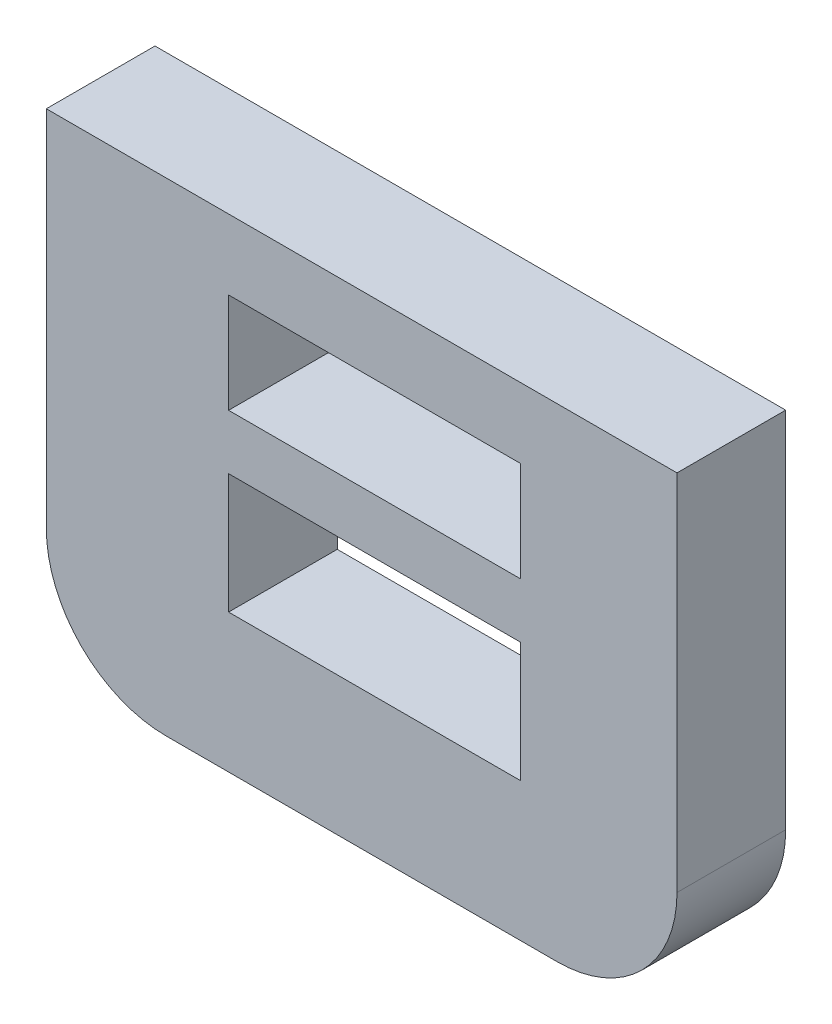
ISO-10303-21;
HEADER;
FILE_DESCRIPTION(('STEP AP214'),'2;1');
FILE_NAME('part.step','',(''),(''),'','','');
FILE_SCHEMA(('AUTOMOTIVE_DESIGN { 1 0 10303 214 1 1 1 1 }'));
ENDSEC;
DATA;
#1=APPLICATION_CONTEXT('core data for automotive mechanical design processes');
#2=APPLICATION_PROTOCOL_DEFINITION('international standard','automotive_design',2000,#1);
#3=PRODUCT_CONTEXT('',#1,'mechanical');
#4=PRODUCT('Part','Part','',(#3));
#5=PRODUCT_RELATED_PRODUCT_CATEGORY('part','',(#4));
#6=PRODUCT_DEFINITION_FORMATION('','',#4);
#7=PRODUCT_DEFINITION_CONTEXT('part definition',#1,'design');
#8=PRODUCT_DEFINITION('design','',#6,#7);
#9=PRODUCT_DEFINITION_SHAPE('','',#8);
#10=(LENGTH_UNIT() NAMED_UNIT(*) SI_UNIT(.MILLI.,.METRE.));
#11=(NAMED_UNIT(*) PLANE_ANGLE_UNIT() SI_UNIT($,.RADIAN.));
#12=(NAMED_UNIT(*) SI_UNIT($,.STERADIAN.) SOLID_ANGLE_UNIT());
#13=UNCERTAINTY_MEASURE_WITH_UNIT(LENGTH_MEASURE(1.E-05),#10,'distance_accuracy_value','');
#14=(GEOMETRIC_REPRESENTATION_CONTEXT(3) GLOBAL_UNCERTAINTY_ASSIGNED_CONTEXT((#13)) GLOBAL_UNIT_ASSIGNED_CONTEXT((#10,
#11,#12)) REPRESENTATION_CONTEXT('',''));
#15=CARTESIAN_POINT('',(0.,0.,0.));
#16=DIRECTION('',(0.,0.,1.));
#17=DIRECTION('',(1.,0.,0.));
#18=AXIS2_PLACEMENT_3D('',#15,#16,#17);
#19=CARTESIAN_POINT('',(-38.033753800412,-414.522040930803,22.6018486611492));
#20=DIRECTION('',(1.,0.,0.));
#21=DIRECTION('',(0.,1.,0.));
#22=AXIS2_PLACEMENT_3D('',#19,#20,#21);
#23=PLANE('',#22);
#24=DIRECTION('',(0.,-1.,0.));
#25=VECTOR('',#24,1.);
#26=CARTESIAN_POINT('',(-38.033753800412,-414.522040930802,2.71944846988061));
#27=LINE('',#26,#25);
#28=CARTESIAN_POINT('',(-38.0337538004116,-405.428571357745,2.71944846988085));
#29=VERTEX_POINT('',#28);
#30=CARTESIAN_POINT('',(-38.033753800412,-414.522040930803,2.71944846988061));
#31=VERTEX_POINT('',#30);
#32=EDGE_CURVE('E271',#29,#31,#27,.T.);
#33=ORIENTED_EDGE('',*,*,#32,.F.);
#34=DIRECTION('',(0.,0.,-1.));
#35=VECTOR('',#34,1.);
#36=CARTESIAN_POINT('',(-38.0337538004116,-405.428571357745,22.6018486611492));
#37=LINE('',#36,#35);
#38=CARTESIAN_POINT('',(-38.0337538004116,-405.428571357745,0.));
#39=VERTEX_POINT('',#38);
#40=EDGE_CURVE('E47',#29,#39,#37,.T.);
#41=ORIENTED_EDGE('',*,*,#40,.T.);
#42=DIRECTION('',(0.,-1.,0.));
#43=VECTOR('',#42,1.);
#44=CARTESIAN_POINT('',(-38.033753800412,-414.522040930803,0.));
#45=LINE('',#44,#43);
#46=CARTESIAN_POINT('',(-38.033753800412,-414.522040930803,0.));
#47=VERTEX_POINT('',#46);
#48=EDGE_CURVE('E195',#39,#47,#45,.T.);
#49=ORIENTED_EDGE('',*,*,#48,.T.);
#50=DIRECTION('',(0.,0.,-1.));
#51=VECTOR('',#50,1.);
#52=CARTESIAN_POINT('',(-38.033753800412,-414.522040930803,22.6018486611492));
#53=LINE('',#52,#51);
#54=EDGE_CURVE('E198',#31,#47,#53,.T.);
#55=ORIENTED_EDGE('',*,*,#54,.F.);
#56=EDGE_LOOP('',(#33,#41,#49,#55));
#57=FACE_BOUND('',#56,.T.);
#58=ADVANCED_FACE('F32',(#57),#23,.F.);
#59=CARTESIAN_POINT('',(-38.0337538004116,-405.428571357745,22.6018486611492));
#60=DIRECTION('',(0.,-1.,0.));
#61=DIRECTION('',(1.,0.,0.));
#62=AXIS2_PLACEMENT_3D('',#59,#60,#61);
#63=PLANE('',#62);
#64=DIRECTION('',(-1.,0.,0.));
#65=VECTOR('',#64,1.);
#66=CARTESIAN_POINT('',(-38.0337538004116,-405.428571357745,2.71944846988108));
#67=LINE('',#66,#65);
#68=CARTESIAN_POINT('',(-22.2521876217571,-405.428571357747,2.71944846988108));
#69=VERTEX_POINT('',#68);
#70=EDGE_CURVE('E230',#69,#29,#67,.T.);
#71=ORIENTED_EDGE('',*,*,#70,.F.);
#72=DIRECTION('',(0.,0.,-1.));
#73=VECTOR('',#72,1.);
#74=CARTESIAN_POINT('',(-22.2521876217571,-405.428571357747,22.6018486611492));
#75=LINE('',#74,#73);
#76=CARTESIAN_POINT('',(-22.2521876217571,-405.428571357747,0.));
#77=VERTEX_POINT('',#76);
#78=EDGE_CURVE('E201',#69,#77,#75,.T.);
#79=ORIENTED_EDGE('',*,*,#78,.T.);
#80=DIRECTION('',(-1.,0.,0.));
#81=VECTOR('',#80,1.);
#82=CARTESIAN_POINT('',(-38.0337538004116,-405.428571357745,0.));
#83=LINE('',#82,#81);
#84=EDGE_CURVE('E193',#77,#39,#83,.T.);
#85=ORIENTED_EDGE('',*,*,#84,.T.);
#86=ORIENTED_EDGE('',*,*,#40,.F.);
#87=EDGE_LOOP('',(#71,#79,#85,#86));
#88=FACE_BOUND('',#87,.T.);
#89=ADVANCED_FACE('F227',(#88),#63,.F.);
#90=CARTESIAN_POINT('',(-22.2521876217571,-405.428571357747,22.6018486611492));
#91=DIRECTION('',(-1.,0.,0.));
#92=DIRECTION('',(0.,-1.,0.));
#93=AXIS2_PLACEMENT_3D('',#90,#91,#92);
#94=PLANE('',#93);
#95=DIRECTION('',(0.,1.,0.));
#96=VECTOR('',#95,1.);
#97=CARTESIAN_POINT('',(-22.2521876217571,-405.428571357746,2.71944846988108));
#98=LINE('',#97,#96);
#99=CARTESIAN_POINT('',(-22.2521876217575,-414.522040930804,2.71944846988084));
#100=VERTEX_POINT('',#99);
#101=EDGE_CURVE('E235',#100,#69,#98,.T.);
#102=ORIENTED_EDGE('',*,*,#101,.F.);
#103=DIRECTION('',(0.,0.,-1.));
#104=VECTOR('',#103,1.);
#105=CARTESIAN_POINT('',(-22.2521876217575,-414.522040930804,22.6018486611492));
#106=LINE('',#105,#104);
#107=CARTESIAN_POINT('',(-22.2521876217575,-414.522040930804,0.));
#108=VERTEX_POINT('',#107);
#109=EDGE_CURVE('E203',#100,#108,#106,.T.);
#110=ORIENTED_EDGE('',*,*,#109,.T.);
#111=DIRECTION('',(0.,1.,0.));
#112=VECTOR('',#111,1.);
#113=CARTESIAN_POINT('',(-22.2521876217571,-405.428571357747,0.));
#114=LINE('',#113,#112);
#115=EDGE_CURVE('E190',#108,#77,#114,.T.);
#116=ORIENTED_EDGE('',*,*,#115,.T.);
#117=ORIENTED_EDGE('',*,*,#78,.F.);
#118=EDGE_LOOP('',(#102,#110,#116,#117));
#119=FACE_BOUND('',#118,.T.);
#120=ADVANCED_FACE('F233',(#119),#94,.F.);
#121=CARTESIAN_POINT('',(-25.2521876217575,-414.522040930804,22.6018486611492));
#122=DIRECTION('',(0.,0.,-1.));
#123=DIRECTION('',(-1.,0.,0.));
#124=AXIS2_PLACEMENT_3D('',#121,#122,#123);
#125=CYLINDRICAL_SURFACE('',#124,3.);
#126=CARTESIAN_POINT('',(-25.2521876217575,-414.522040930804,2.71944846988061));
#127=DIRECTION('',(0.,0.,1.));
#128=DIRECTION('',(0.,-1.,0.));
#129=AXIS2_PLACEMENT_3D('',#126,#127,#128);
#130=CIRCLE('',#129,3.);
#131=CARTESIAN_POINT('',(-25.2521876217578,-417.522040930804,2.71944846988045));
#132=VERTEX_POINT('',#131);
#133=EDGE_CURVE('E239',#132,#100,#130,.T.);
#134=ORIENTED_EDGE('',*,*,#133,.F.);
#135=DIRECTION('',(0.,0.,-1.));
#136=VECTOR('',#135,1.);
#137=CARTESIAN_POINT('',(-25.2521876217578,-417.522040930804,22.6018486611492));
#138=LINE('',#137,#136);
#139=CARTESIAN_POINT('',(-25.2521876217578,-417.522040930804,0.));
#140=VERTEX_POINT('',#139);
#141=EDGE_CURVE('E205',#132,#140,#138,.T.);
#142=ORIENTED_EDGE('',*,*,#141,.T.);
#143=CARTESIAN_POINT('',(-25.2521876217575,-414.522040930804,0.));
#144=DIRECTION('',(0.,0.,1.));
#145=DIRECTION('',(1.,0.,0.));
#146=AXIS2_PLACEMENT_3D('',#143,#144,#145);
#147=CIRCLE('',#146,3.);
#148=EDGE_CURVE('E187',#140,#108,#147,.T.);
#149=ORIENTED_EDGE('',*,*,#148,.T.);
#150=ORIENTED_EDGE('',*,*,#109,.F.);
#151=EDGE_LOOP('',(#134,#142,#149,#150));
#152=FACE_BOUND('',#151,.T.);
#153=ADVANCED_FACE('F238',(#152),#125,.T.);
#154=CARTESIAN_POINT('',(-25.2521876217578,-417.522040930804,22.6018486611492));
#155=DIRECTION('',(0.,1.,0.));
#156=DIRECTION('',(-1.,0.,0.));
#157=AXIS2_PLACEMENT_3D('',#154,#155,#156);
#158=PLANE('',#157);
#159=DIRECTION('',(1.,0.,0.));
#160=VECTOR('',#159,1.);
#161=CARTESIAN_POINT('',(-25.2521876217578,-417.522040930804,2.71944846988045));
#162=LINE('',#161,#160);
#163=CARTESIAN_POINT('',(-35.0337538004122,-417.522040930803,2.71944846988045));
#164=VERTEX_POINT('',#163);
#165=EDGE_CURVE('E213',#164,#132,#162,.T.);
#166=ORIENTED_EDGE('',*,*,#165,.F.);
#167=DIRECTION('',(0.,0.,-1.));
#168=VECTOR('',#167,1.);
#169=CARTESIAN_POINT('',(-35.0337538004122,-417.522040930803,22.6018486611492));
#170=LINE('',#169,#168);
#171=CARTESIAN_POINT('',(-35.0337538004122,-417.522040930803,0.));
#172=VERTEX_POINT('',#171);
#173=EDGE_CURVE('E40',#164,#172,#170,.T.);
#174=ORIENTED_EDGE('',*,*,#173,.T.);
#175=DIRECTION('',(1.,0.,0.));
#176=VECTOR('',#175,1.);
#177=CARTESIAN_POINT('',(-25.2521876217578,-417.522040930804,0.));
#178=LINE('',#177,#176);
#179=EDGE_CURVE('E184',#172,#140,#178,.T.);
#180=ORIENTED_EDGE('',*,*,#179,.T.);
#181=ORIENTED_EDGE('',*,*,#141,.F.);
#182=EDGE_LOOP('',(#166,#174,#180,#181));
#183=FACE_BOUND('',#182,.T.);
#184=ADVANCED_FACE('F209',(#183),#158,.F.);
#185=CARTESIAN_POINT('',(-35.033753800412,-414.522040930803,22.6018486611492));
#186=DIRECTION('',(0.,0.,-1.));
#187=DIRECTION('',(-1.,0.,0.));
#188=AXIS2_PLACEMENT_3D('',#185,#186,#187);
#189=CYLINDRICAL_SURFACE('',#188,3.00000000000001);
#190=CARTESIAN_POINT('',(-35.033753800412,-414.522040930803,2.71944846988061));
#191=DIRECTION('',(0.,0.,1.));
#192=DIRECTION('',(0.,-1.,0.));
#193=AXIS2_PLACEMENT_3D('',#190,#191,#192);
#194=CIRCLE('',#193,3.00000000000001);
#195=EDGE_CURVE('E223',#31,#164,#194,.T.);
#196=ORIENTED_EDGE('',*,*,#195,.F.);
#197=ORIENTED_EDGE('',*,*,#54,.T.);
#198=CARTESIAN_POINT('',(-35.033753800412,-414.522040930803,0.));
#199=DIRECTION('',(0.,0.,1.));
#200=DIRECTION('',(1.,0.,0.));
#201=AXIS2_PLACEMENT_3D('',#198,#199,#200);
#202=CIRCLE('',#201,3.00000000000001);
#203=EDGE_CURVE('E181',#47,#172,#202,.T.);
#204=ORIENTED_EDGE('',*,*,#203,.T.);
#205=ORIENTED_EDGE('',*,*,#173,.F.);
#206=EDGE_LOOP('',(#196,#197,#204,#205));
#207=FACE_BOUND('',#206,.T.);
#208=ADVANCED_FACE('F34',(#207),#189,.T.);
#209=CARTESIAN_POINT('',(-33.4727150959694,-411.055740741814,22.6018486611492));
#210=DIRECTION('',(1.,0.,0.));
#211=DIRECTION('',(0.,1.,0.));
#212=AXIS2_PLACEMENT_3D('',#209,#210,#211);
#213=PLANE('',#212);
#214=DIRECTION('',(0.,0.,-1.));
#215=VECTOR('',#214,1.);
#216=CARTESIAN_POINT('',(-33.4727150959694,-411.055740741814,22.6018486611492));
#217=LINE('',#216,#215);
#218=CARTESIAN_POINT('',(-33.4727150959694,-411.055740741814,2.71944846988079));
#219=VERTEX_POINT('',#218);
#220=CARTESIAN_POINT('',(-33.4727150959694,-411.055740741814,0.));
#221=VERTEX_POINT('',#220);
#222=EDGE_CURVE('E175',#219,#221,#217,.T.);
#223=ORIENTED_EDGE('',*,*,#222,.F.);
#224=DIRECTION('',(0.,-1.,0.));
#225=VECTOR('',#224,1.);
#226=CARTESIAN_POINT('',(-33.4727150959694,-411.055740741813,2.71944846988079));
#227=LINE('',#226,#225);
#228=CARTESIAN_POINT('',(-33.4727150959696,-414.055740741813,2.71944846988071));
#229=VERTEX_POINT('',#228);
#230=EDGE_CURVE('E259',#219,#229,#227,.T.);
#231=ORIENTED_EDGE('',*,*,#230,.T.);
#232=DIRECTION('',(0.,0.,-1.));
#233=VECTOR('',#232,1.);
#234=CARTESIAN_POINT('',(-33.4727150959696,-414.055740741813,22.6018486611492));
#235=LINE('',#234,#233);
#236=CARTESIAN_POINT('',(-33.4727150959696,-414.055740741813,0.));
#237=VERTEX_POINT('',#236);
#238=EDGE_CURVE('E173',#229,#237,#235,.T.);
#239=ORIENTED_EDGE('',*,*,#238,.T.);
#240=DIRECTION('',(0.,-1.,0.));
#241=VECTOR('',#240,1.);
#242=CARTESIAN_POINT('',(-33.4727150959694,-411.055740741814,0.));
#243=LINE('',#242,#241);
#244=EDGE_CURVE('E170',#221,#237,#243,.T.);
#245=ORIENTED_EDGE('',*,*,#244,.F.);
#246=EDGE_LOOP('',(#223,#231,#239,#245));
#247=FACE_BOUND('',#246,.T.);
#248=ADVANCED_FACE('F281',(#247),#213,.T.);
#249=CARTESIAN_POINT('',(-26.1675249239516,-411.055740741814,22.6018486611492));
#250=DIRECTION('',(0.,-1.,0.));
#251=DIRECTION('',(1.,0.,0.));
#252=AXIS2_PLACEMENT_3D('',#249,#250,#251);
#253=PLANE('',#252);
#254=DIRECTION('',(0.,0.,-1.));
#255=VECTOR('',#254,1.);
#256=CARTESIAN_POINT('',(-26.1675249239516,-411.055740741814,22.6018486611492));
#257=LINE('',#256,#255);
#258=CARTESIAN_POINT('',(-26.1675249239516,-411.055740741814,2.71944846988079));
#259=VERTEX_POINT('',#258);
#260=CARTESIAN_POINT('',(-26.1675249239516,-411.055740741814,0.));
#261=VERTEX_POINT('',#260);
#262=EDGE_CURVE('E177',#259,#261,#257,.T.);
#263=ORIENTED_EDGE('',*,*,#262,.F.);
#264=DIRECTION('',(-1.,0.,0.));
#265=VECTOR('',#264,1.);
#266=CARTESIAN_POINT('',(-26.1675249239516,-411.055740741814,2.71944846988079));
#267=LINE('',#266,#265);
#268=EDGE_CURVE('E264',#259,#219,#267,.T.);
#269=ORIENTED_EDGE('',*,*,#268,.T.);
#270=ORIENTED_EDGE('',*,*,#222,.T.);
#271=DIRECTION('',(-1.,0.,0.));
#272=VECTOR('',#271,1.);
#273=CARTESIAN_POINT('',(-26.1675249239516,-411.055740741814,0.));
#274=LINE('',#273,#272);
#275=EDGE_CURVE('E167',#261,#221,#274,.T.);
#276=ORIENTED_EDGE('',*,*,#275,.F.);
#277=EDGE_LOOP('',(#263,#269,#270,#276));
#278=FACE_BOUND('',#277,.T.);
#279=ADVANCED_FACE('F284',(#278),#253,.T.);
#280=CARTESIAN_POINT('',(-26.1675249239518,-414.055740741814,22.6018486611492));
#281=DIRECTION('',(-1.,0.,0.));
#282=DIRECTION('',(0.,-1.,0.));
#283=AXIS2_PLACEMENT_3D('',#280,#281,#282);
#284=PLANE('',#283);
#285=DIRECTION('',(0.,0.,-1.));
#286=VECTOR('',#285,1.);
#287=CARTESIAN_POINT('',(-26.1675249239518,-414.055740741814,22.6018486611492));
#288=LINE('',#287,#286);
#289=CARTESIAN_POINT('',(-26.1675249239518,-414.055740741814,2.71944846988063));
#290=VERTEX_POINT('',#289);
#291=CARTESIAN_POINT('',(-26.1675249239518,-414.055740741814,0.));
#292=VERTEX_POINT('',#291);
#293=EDGE_CURVE('E179',#290,#292,#288,.T.);
#294=ORIENTED_EDGE('',*,*,#293,.F.);
#295=DIRECTION('',(0.,1.,0.));
#296=VECTOR('',#295,1.);
#297=CARTESIAN_POINT('',(-26.1675249239518,-414.055740741813,2.71944846988063));
#298=LINE('',#297,#296);
#299=EDGE_CURVE('E267',#290,#259,#298,.T.);
#300=ORIENTED_EDGE('',*,*,#299,.T.);
#301=ORIENTED_EDGE('',*,*,#262,.T.);
#302=DIRECTION('',(0.,1.,0.));
#303=VECTOR('',#302,1.);
#304=CARTESIAN_POINT('',(-26.1675249239518,-414.055740741814,0.));
#305=LINE('',#304,#303);
#306=EDGE_CURVE('E164',#292,#261,#305,.T.);
#307=ORIENTED_EDGE('',*,*,#306,.F.);
#308=EDGE_LOOP('',(#294,#300,#301,#307));
#309=FACE_BOUND('',#308,.T.);
#310=ADVANCED_FACE('F287',(#309),#284,.T.);
#311=CARTESIAN_POINT('',(-33.4727150959696,-414.055740741813,22.6018486611492));
#312=DIRECTION('',(0.,1.,0.));
#313=DIRECTION('',(-1.,0.,0.));
#314=AXIS2_PLACEMENT_3D('',#311,#312,#313);
#315=PLANE('',#314);
#316=ORIENTED_EDGE('',*,*,#238,.F.);
#317=DIRECTION('',(1.,0.,0.));
#318=VECTOR('',#317,1.);
#319=CARTESIAN_POINT('',(-33.4727150959696,-414.055740741813,2.71944846988063));
#320=LINE('',#319,#318);
#321=EDGE_CURVE('E55',#229,#290,#320,.T.);
#322=ORIENTED_EDGE('',*,*,#321,.T.);
#323=ORIENTED_EDGE('',*,*,#293,.T.);
#324=DIRECTION('',(1.,0.,0.));
#325=VECTOR('',#324,1.);
#326=CARTESIAN_POINT('',(-33.4727150959696,-414.055740741813,0.));
#327=LINE('',#326,#325);
#328=EDGE_CURVE('E161',#237,#292,#327,.T.);
#329=ORIENTED_EDGE('',*,*,#328,.F.);
#330=EDGE_LOOP('',(#316,#322,#323,#329));
#331=FACE_BOUND('',#330,.T.);
#332=ADVANCED_FACE('F274',(#331),#315,.T.);
#333=CARTESIAN_POINT('',(-35.033753800412,-414.522040930803,0.));
#334=DIRECTION('',(0.,0.,1.));
#335=DIRECTION('',(1.,0.,0.));
#336=AXIS2_PLACEMENT_3D('',#333,#334,#335);
#337=PLANE('',#336);
#338=ORIENTED_EDGE('',*,*,#328,.T.);
#339=ORIENTED_EDGE('',*,*,#306,.T.);
#340=ORIENTED_EDGE('',*,*,#275,.T.);
#341=ORIENTED_EDGE('',*,*,#244,.T.);
#342=EDGE_LOOP('',(#338,#339,#340,#341));
#343=FACE_BOUND('',#342,.T.);
#344=ORIENTED_EDGE('',*,*,#203,.F.);
#345=ORIENTED_EDGE('',*,*,#48,.F.);
#346=ORIENTED_EDGE('',*,*,#84,.F.);
#347=ORIENTED_EDGE('',*,*,#115,.F.);
#348=ORIENTED_EDGE('',*,*,#148,.F.);
#349=ORIENTED_EDGE('',*,*,#179,.F.);
#350=EDGE_LOOP('',(#344,#345,#346,#347,#348,#349));
#351=FACE_BOUND('',#350,.T.);
#352=DIRECTION('',(0.,-1.,0.));
#353=VECTOR('',#352,1.);
#354=CARTESIAN_POINT('',(-33.4727150959637,-407.182910125892,0.));
#355=LINE('',#354,#353);
#356=CARTESIAN_POINT('',(-33.4727150959637,-407.182910125892,0.));
#357=VERTEX_POINT('',#356);
#358=CARTESIAN_POINT('',(-33.4727150959639,-409.682910125892,0.));
#359=VERTEX_POINT('',#358);
#360=EDGE_CURVE('E242',#357,#359,#355,.T.);
#361=ORIENTED_EDGE('',*,*,#360,.T.);
#362=DIRECTION('',(1.,0.,0.));
#363=VECTOR('',#362,1.);
#364=CARTESIAN_POINT('',(-26.1675249239509,-409.682910125892,0.));
#365=LINE('',#364,#363);
#366=CARTESIAN_POINT('',(-26.1675249239509,-409.682910125892,0.));
#367=VERTEX_POINT('',#366);
#368=EDGE_CURVE('E249',#359,#367,#365,.T.);
#369=ORIENTED_EDGE('',*,*,#368,.T.);
#370=DIRECTION('',(0.,1.,0.));
#371=VECTOR('',#370,1.);
#372=CARTESIAN_POINT('',(-26.1675249239509,-409.682910125892,0.));
#373=LINE('',#372,#371);
#374=CARTESIAN_POINT('',(-26.1675249239507,-407.182910125892,0.));
#375=VERTEX_POINT('',#374);
#376=EDGE_CURVE('E252',#367,#375,#373,.T.);
#377=ORIENTED_EDGE('',*,*,#376,.T.);
#378=DIRECTION('',(-1.,0.,0.));
#379=VECTOR('',#378,1.);
#380=CARTESIAN_POINT('',(-26.1675249239507,-407.182910125892,0.));
#381=LINE('',#380,#379);
#382=EDGE_CURVE('E151',#375,#357,#381,.T.);
#383=ORIENTED_EDGE('',*,*,#382,.T.);
#384=EDGE_LOOP('',(#361,#369,#377,#383));
#385=FACE_BOUND('',#384,.T.);
#386=ADVANCED_FACE('F219',(#343,#351,#385),#337,.F.);
#387=CARTESIAN_POINT('',(-26.1675249239507,-407.182910125892,22.6018486611492));
#388=DIRECTION('',(0.,-1.,0.));
#389=DIRECTION('',(1.,0.,0.));
#390=AXIS2_PLACEMENT_3D('',#387,#388,#389);
#391=PLANE('',#390);
#392=DIRECTION('',(0.,0.,-1.));
#393=VECTOR('',#392,1.);
#394=CARTESIAN_POINT('',(-26.1675249239507,-407.182910125892,22.6018486611492));
#395=LINE('',#394,#393);
#396=CARTESIAN_POINT('',(-26.1675249239507,-407.182910125892,2.71944846988099));
#397=VERTEX_POINT('',#396);
#398=EDGE_CURVE('E143',#397,#375,#395,.T.);
#399=ORIENTED_EDGE('',*,*,#398,.F.);
#400=DIRECTION('',(-1.,0.,0.));
#401=VECTOR('',#400,1.);
#402=CARTESIAN_POINT('',(-26.1675249239508,-407.182910125892,2.71944846988099));
#403=LINE('',#402,#401);
#404=CARTESIAN_POINT('',(-33.4727150959637,-407.182910125892,2.71944846988099));
#405=VERTEX_POINT('',#404);
#406=EDGE_CURVE('E11',#397,#405,#403,.T.);
#407=ORIENTED_EDGE('',*,*,#406,.T.);
#408=DIRECTION('',(0.,0.,-1.));
#409=VECTOR('',#408,1.);
#410=CARTESIAN_POINT('',(-33.4727150959637,-407.182910125892,22.6018486611492));
#411=LINE('',#410,#409);
#412=EDGE_CURVE('E153',#405,#357,#411,.T.);
#413=ORIENTED_EDGE('',*,*,#412,.T.);
#414=ORIENTED_EDGE('',*,*,#382,.F.);
#415=EDGE_LOOP('',(#399,#407,#413,#414));
#416=FACE_BOUND('',#415,.T.);
#417=ADVANCED_FACE('F149',(#416),#391,.T.);
#418=CARTESIAN_POINT('',(-26.1675249239509,-409.682910125892,22.6018486611492));
#419=DIRECTION('',(-1.,0.,0.));
#420=DIRECTION('',(0.,-1.,0.));
#421=AXIS2_PLACEMENT_3D('',#418,#419,#420);
#422=PLANE('',#421);
#423=DIRECTION('',(0.,0.,-1.));
#424=VECTOR('',#423,1.);
#425=CARTESIAN_POINT('',(-26.1675249239509,-409.682910125892,22.6018486611492));
#426=LINE('',#425,#424);
#427=CARTESIAN_POINT('',(-26.1675249239509,-409.682910125892,2.71944846988086));
#428=VERTEX_POINT('',#427);
#429=EDGE_CURVE('E145',#428,#367,#426,.T.);
#430=ORIENTED_EDGE('',*,*,#429,.F.);
#431=DIRECTION('',(0.,1.,0.));
#432=VECTOR('',#431,1.);
#433=CARTESIAN_POINT('',(-26.1675249239509,-409.682910125891,2.71944846988086));
#434=LINE('',#433,#432);
#435=EDGE_CURVE('E133',#428,#397,#434,.T.);
#436=ORIENTED_EDGE('',*,*,#435,.T.);
#437=ORIENTED_EDGE('',*,*,#398,.T.);
#438=ORIENTED_EDGE('',*,*,#376,.F.);
#439=EDGE_LOOP('',(#430,#436,#437,#438));
#440=FACE_BOUND('',#439,.T.);
#441=ADVANCED_FACE('F141',(#440),#422,.T.);
#442=CARTESIAN_POINT('',(-26.1675249239509,-409.682910125892,22.6018486611492));
#443=DIRECTION('',(0.,1.,0.));
#444=DIRECTION('',(-1.,0.,0.));
#445=AXIS2_PLACEMENT_3D('',#442,#443,#444);
#446=PLANE('',#445);
#447=DIRECTION('',(0.,0.,-1.));
#448=VECTOR('',#447,1.);
#449=CARTESIAN_POINT('',(-33.4727150959639,-409.682910125892,22.6018486611492));
#450=LINE('',#449,#448);
#451=CARTESIAN_POINT('',(-33.4727150959639,-409.682910125892,2.71944846988086));
#452=VERTEX_POINT('',#451);
#453=EDGE_CURVE('E155',#452,#359,#450,.T.);
#454=ORIENTED_EDGE('',*,*,#453,.F.);
#455=DIRECTION('',(1.,0.,0.));
#456=VECTOR('',#455,1.);
#457=CARTESIAN_POINT('',(-26.1675249239509,-409.682910125892,2.71944846988086));
#458=LINE('',#457,#456);
#459=EDGE_CURVE('E147',#452,#428,#458,.T.);
#460=ORIENTED_EDGE('',*,*,#459,.T.);
#461=ORIENTED_EDGE('',*,*,#429,.T.);
#462=ORIENTED_EDGE('',*,*,#368,.F.);
#463=EDGE_LOOP('',(#454,#460,#461,#462));
#464=FACE_BOUND('',#463,.T.);
#465=ADVANCED_FACE('F257',(#464),#446,.T.);
#466=CARTESIAN_POINT('',(-33.4727150959637,-407.182910125892,22.6018486611492));
#467=DIRECTION('',(1.,0.,0.));
#468=DIRECTION('',(0.,1.,0.));
#469=AXIS2_PLACEMENT_3D('',#466,#467,#468);
#470=PLANE('',#469);
#471=ORIENTED_EDGE('',*,*,#412,.F.);
#472=DIRECTION('',(0.,-1.,0.));
#473=VECTOR('',#472,1.);
#474=CARTESIAN_POINT('',(-33.4727150959637,-407.18291012589,2.71944846988099));
#475=LINE('',#474,#473);
#476=EDGE_CURVE('E136',#405,#452,#475,.T.);
#477=ORIENTED_EDGE('',*,*,#476,.T.);
#478=ORIENTED_EDGE('',*,*,#453,.T.);
#479=ORIENTED_EDGE('',*,*,#360,.F.);
#480=EDGE_LOOP('',(#471,#477,#478,#479));
#481=FACE_BOUND('',#480,.T.);
#482=ADVANCED_FACE('F320',(#481),#470,.T.);
#483=CARTESIAN_POINT('',(-32.918539046089,-352.939741266353,2.71944846988382));
#484=DIRECTION('',(0.,0.,1.));
#485=DIRECTION('',(0.,-1.,0.));
#486=AXIS2_PLACEMENT_3D('',#483,#484,#485);
#487=PLANE('',#486);
#488=ORIENTED_EDGE('',*,*,#476,.F.);
#489=ORIENTED_EDGE('',*,*,#406,.F.);
#490=ORIENTED_EDGE('',*,*,#435,.F.);
#491=ORIENTED_EDGE('',*,*,#459,.F.);
#492=EDGE_LOOP('',(#488,#489,#490,#491));
#493=FACE_BOUND('',#492,.T.);
#494=ORIENTED_EDGE('',*,*,#321,.F.);
#495=ORIENTED_EDGE('',*,*,#230,.F.);
#496=ORIENTED_EDGE('',*,*,#268,.F.);
#497=ORIENTED_EDGE('',*,*,#299,.F.);
#498=EDGE_LOOP('',(#494,#495,#496,#497));
#499=FACE_BOUND('',#498,.T.);
#500=ORIENTED_EDGE('',*,*,#32,.T.);
#501=ORIENTED_EDGE('',*,*,#195,.T.);
#502=ORIENTED_EDGE('',*,*,#165,.T.);
#503=ORIENTED_EDGE('',*,*,#133,.T.);
#504=ORIENTED_EDGE('',*,*,#101,.T.);
#505=ORIENTED_EDGE('',*,*,#70,.T.);
#506=EDGE_LOOP('',(#500,#501,#502,#503,#504,#505));
#507=FACE_BOUND('',#506,.T.);
#508=ADVANCED_FACE('F132',(#493,#499,#507),#487,.T.);
#509=CLOSED_SHELL('',(#58,#89,#120,#153,#184,#208,#248,#279,#310,#332,#386,#417,#441,#465,#482,#508));
#510=MANIFOLD_SOLID_BREP('B2',#509);
#511=ADVANCED_BREP_SHAPE_REPRESENTATION('',(#18,#510),#14);
#512=SHAPE_DEFINITION_REPRESENTATION(#9,#511);
ENDSEC;
END-ISO-10303-21;
